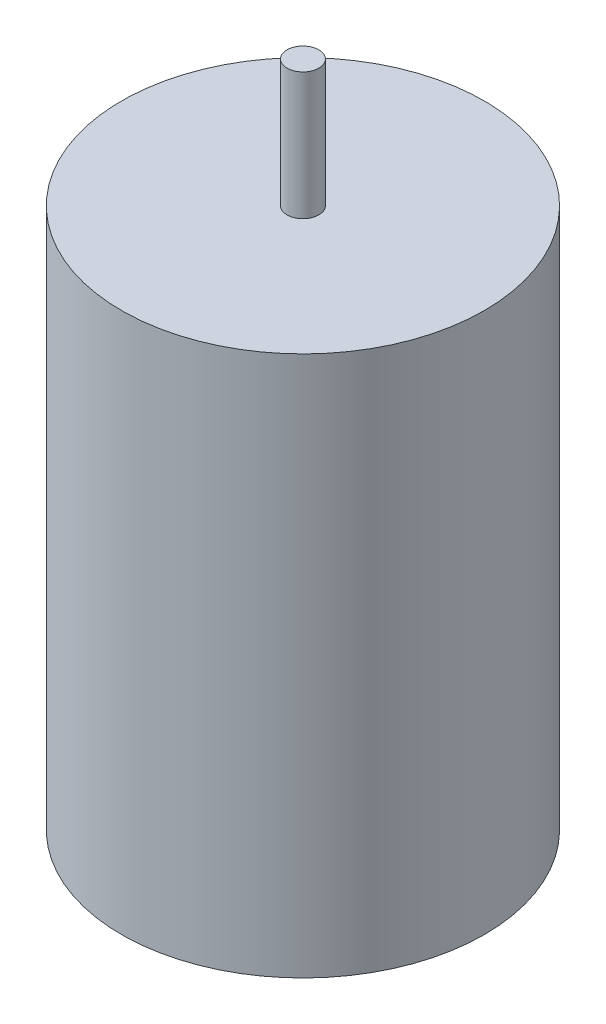
ISO-10303-21;
HEADER;
FILE_DESCRIPTION(('STEP AP214'),'2;1');
FILE_NAME('part.step','',(''),(''),'','','');
FILE_SCHEMA(('AUTOMOTIVE_DESIGN { 1 0 10303 214 1 1 1 1 }'));
ENDSEC;
DATA;
#1=APPLICATION_CONTEXT('core data for automotive mechanical design processes');
#2=APPLICATION_PROTOCOL_DEFINITION('international standard','automotive_design',2000,#1);
#3=PRODUCT_CONTEXT('',#1,'mechanical');
#4=PRODUCT('Part','Part','',(#3));
#5=PRODUCT_RELATED_PRODUCT_CATEGORY('part','',(#4));
#6=PRODUCT_DEFINITION_FORMATION('','',#4);
#7=PRODUCT_DEFINITION_CONTEXT('part definition',#1,'design');
#8=PRODUCT_DEFINITION('design','',#6,#7);
#9=PRODUCT_DEFINITION_SHAPE('','',#8);
#10=(LENGTH_UNIT() NAMED_UNIT(*) SI_UNIT(.MILLI.,.METRE.));
#11=(NAMED_UNIT(*) PLANE_ANGLE_UNIT() SI_UNIT($,.RADIAN.));
#12=(NAMED_UNIT(*) SI_UNIT($,.STERADIAN.) SOLID_ANGLE_UNIT());
#13=UNCERTAINTY_MEASURE_WITH_UNIT(LENGTH_MEASURE(1.E-05),#10,'distance_accuracy_value','');
#14=(GEOMETRIC_REPRESENTATION_CONTEXT(3) GLOBAL_UNCERTAINTY_ASSIGNED_CONTEXT((#13)) GLOBAL_UNIT_ASSIGNED_CONTEXT((#10,
#11,#12)) REPRESENTATION_CONTEXT('',''));
#15=CARTESIAN_POINT('',(0.,0.,0.));
#16=DIRECTION('',(0.,0.,1.));
#17=DIRECTION('',(1.,0.,0.));
#18=AXIS2_PLACEMENT_3D('',#15,#16,#17);
#19=CARTESIAN_POINT('',(0.,66.7,0.));
#20=DIRECTION('',(0.,1.,0.));
#21=DIRECTION('',(-1.,0.,0.));
#22=AXIS2_PLACEMENT_3D('',#19,#20,#21);
#23=PLANE('',#22);
#24=CARTESIAN_POINT('',(0.,66.7,0.));
#25=DIRECTION('',(0.,-1.,0.));
#26=DIRECTION('',(1.,0.,0.));
#27=AXIS2_PLACEMENT_3D('',#24,#25,#26);
#28=CIRCLE('',#27,1.58750000000002);
#29=CARTESIAN_POINT('',(1.5875,66.7,0.));
#30=VERTEX_POINT('',#29);
#31=EDGE_CURVE('E10',#30,#30,#28,.T.);
#32=ORIENTED_EDGE('',*,*,#31,.F.);
#33=EDGE_LOOP('',(#32));
#34=FACE_BOUND('',#33,.T.);
#35=ADVANCED_FACE('F35',(#34),#23,.T.);
#36=CARTESIAN_POINT('',(0.,-66.7,0.));
#37=DIRECTION('',(0.,-1.,0.));
#38=DIRECTION('',(1.,0.,0.));
#39=AXIS2_PLACEMENT_3D('',#36,#37,#38);
#40=CYLINDRICAL_SURFACE('',#39,1.58750000000002);
#41=ORIENTED_EDGE('',*,*,#31,.T.);
#42=EDGE_LOOP('',(#41));
#43=FACE_BOUND('',#42,.T.);
#44=CARTESIAN_POINT('',(0.,54.,0.));
#45=DIRECTION('',(0.,-1.,0.));
#46=DIRECTION('',(1.,0.,0.));
#47=AXIS2_PLACEMENT_3D('',#44,#45,#46);
#48=CIRCLE('',#47,1.58750000000002);
#49=CARTESIAN_POINT('',(1.5875,54.,0.));
#50=VERTEX_POINT('',#49);
#51=EDGE_CURVE('E41',#50,#50,#48,.T.);
#52=ORIENTED_EDGE('',*,*,#51,.F.);
#53=EDGE_LOOP('',(#52));
#54=FACE_BOUND('',#53,.T.);
#55=ADVANCED_FACE('F67',(#43,#54),#40,.T.);
#56=CARTESIAN_POINT('',(1.5875,54.,0.));
#57=DIRECTION('',(0.,1.,0.));
#58=DIRECTION('',(-1.,0.,0.));
#59=AXIS2_PLACEMENT_3D('',#56,#57,#58);
#60=PLANE('',#59);
#61=ORIENTED_EDGE('',*,*,#51,.T.);
#62=EDGE_LOOP('',(#61));
#63=FACE_BOUND('',#62,.T.);
#64=CARTESIAN_POINT('',(0.,54.,0.));
#65=DIRECTION('',(0.,-1.,0.));
#66=DIRECTION('',(1.,0.,0.));
#67=AXIS2_PLACEMENT_3D('',#64,#65,#66);
#68=CIRCLE('',#67,18.1316);
#69=CARTESIAN_POINT('',(18.1316,54.,0.));
#70=VERTEX_POINT('',#69);
#71=EDGE_CURVE('E45',#70,#70,#68,.T.);
#72=ORIENTED_EDGE('',*,*,#71,.F.);
#73=EDGE_LOOP('',(#72));
#74=FACE_BOUND('',#73,.T.);
#75=ADVANCED_FACE('F59',(#63,#74),#60,.T.);
#76=CARTESIAN_POINT('',(0.,-66.7,0.));
#77=DIRECTION('',(0.,-1.,0.));
#78=DIRECTION('',(1.,0.,0.));
#79=AXIS2_PLACEMENT_3D('',#76,#77,#78);
#80=CYLINDRICAL_SURFACE('',#79,18.1316);
#81=ORIENTED_EDGE('',*,*,#71,.T.);
#82=EDGE_LOOP('',(#81));
#83=FACE_BOUND('',#82,.T.);
#84=CARTESIAN_POINT('',(0.,0.,0.));
#85=DIRECTION('',(0.,-1.,0.));
#86=DIRECTION('',(1.,0.,0.));
#87=AXIS2_PLACEMENT_3D('',#84,#85,#86);
#88=CIRCLE('',#87,18.1316);
#89=CARTESIAN_POINT('',(18.1316,0.,0.));
#90=VERTEX_POINT('',#89);
#91=EDGE_CURVE('E49',#90,#90,#88,.T.);
#92=ORIENTED_EDGE('',*,*,#91,.F.);
#93=EDGE_LOOP('',(#92));
#94=FACE_BOUND('',#93,.T.);
#95=ADVANCED_FACE('F57',(#83,#94),#80,.T.);
#96=CARTESIAN_POINT('',(18.1316,0.,0.));
#97=DIRECTION('',(0.,-1.,0.));
#98=DIRECTION('',(1.,0.,0.));
#99=AXIS2_PLACEMENT_3D('',#96,#97,#98);
#100=PLANE('',#99);
#101=ORIENTED_EDGE('',*,*,#91,.T.);
#102=EDGE_LOOP('',(#101));
#103=FACE_BOUND('',#102,.T.);
#104=ADVANCED_FACE('F55',(#103),#100,.T.);
#105=CLOSED_SHELL('',(#35,#55,#75,#95,#104));
#106=MANIFOLD_SOLID_BREP('B2',#105);
#107=ADVANCED_BREP_SHAPE_REPRESENTATION('',(#18,#106),#14);
#108=SHAPE_DEFINITION_REPRESENTATION(#9,#107);
ENDSEC;
END-ISO-10303-21;
